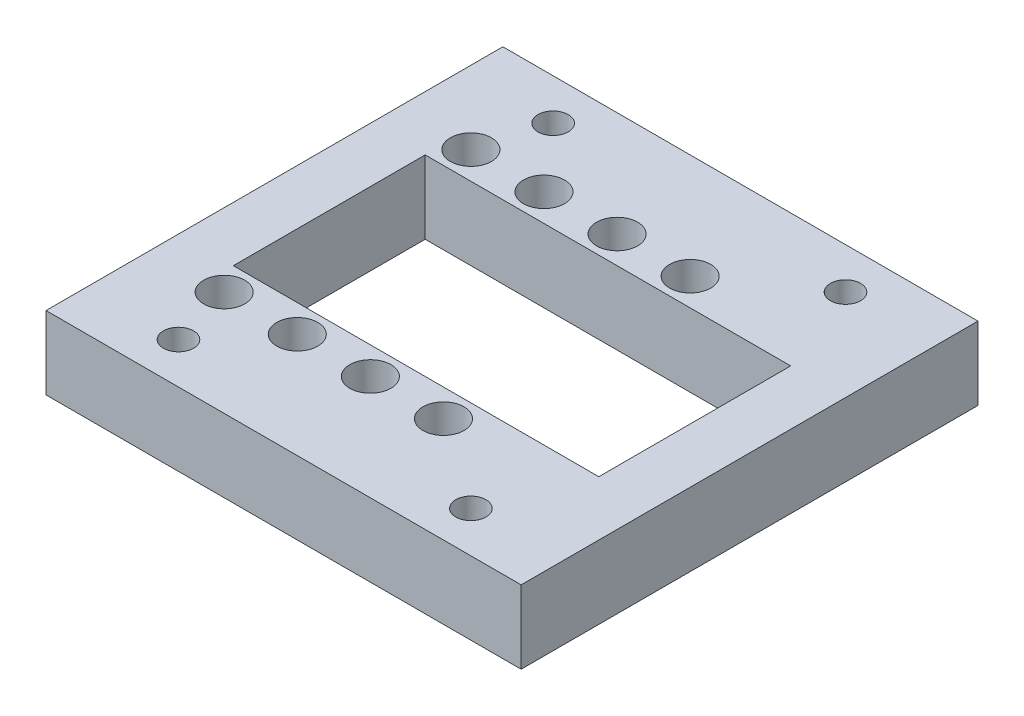
ISO-10303-21;
HEADER;
FILE_DESCRIPTION(('STEP AP214'),'2;1');
FILE_NAME('part.step','',(''),(''),'','','');
FILE_SCHEMA(('AUTOMOTIVE_DESIGN { 1 0 10303 214 1 1 1 1 }'));
ENDSEC;
DATA;
#1=APPLICATION_CONTEXT('core data for automotive mechanical design processes');
#2=APPLICATION_PROTOCOL_DEFINITION('international standard','automotive_design',2000,#1);
#3=PRODUCT_CONTEXT('',#1,'mechanical');
#4=PRODUCT('Part','Part','',(#3));
#5=PRODUCT_RELATED_PRODUCT_CATEGORY('part','',(#4));
#6=PRODUCT_DEFINITION_FORMATION('','',#4);
#7=PRODUCT_DEFINITION_CONTEXT('part definition',#1,'design');
#8=PRODUCT_DEFINITION('design','',#6,#7);
#9=PRODUCT_DEFINITION_SHAPE('','',#8);
#10=(LENGTH_UNIT() NAMED_UNIT(*) SI_UNIT(.MILLI.,.METRE.));
#11=(NAMED_UNIT(*) PLANE_ANGLE_UNIT() SI_UNIT($,.RADIAN.));
#12=(NAMED_UNIT(*) SI_UNIT($,.STERADIAN.) SOLID_ANGLE_UNIT());
#13=UNCERTAINTY_MEASURE_WITH_UNIT(LENGTH_MEASURE(1.E-05),#10,'distance_accuracy_value','');
#14=(GEOMETRIC_REPRESENTATION_CONTEXT(3) GLOBAL_UNCERTAINTY_ASSIGNED_CONTEXT((#13)) GLOBAL_UNIT_ASSIGNED_CONTEXT((#10,
#11,#12)) REPRESENTATION_CONTEXT('',''));
#15=CARTESIAN_POINT('',(0.,0.,0.));
#16=DIRECTION('',(0.,0.,1.));
#17=DIRECTION('',(1.,0.,0.));
#18=AXIS2_PLACEMENT_3D('',#15,#16,#17);
#19=CARTESIAN_POINT('',(0.,8.,13.5));
#20=DIRECTION('',(0.,-1.,0.));
#21=DIRECTION('',(0.,0.,-1.));
#22=AXIS2_PLACEMENT_3D('',#19,#20,#21);
#23=CYLINDRICAL_SURFACE('',#22,1.12499999999999);
#24=CARTESIAN_POINT('',(0.,0.,13.5));
#25=DIRECTION('',(0.,1.,0.));
#26=DIRECTION('',(0.,0.,1.));
#27=AXIS2_PLACEMENT_3D('',#24,#25,#26);
#28=CIRCLE('',#27,1.12499999999999);
#29=CARTESIAN_POINT('',(0.,0.,14.625));
#30=VERTEX_POINT('',#29);
#31=EDGE_CURVE('E187',#30,#30,#28,.F.);
#32=ORIENTED_EDGE('',*,*,#31,.T.);
#33=EDGE_LOOP('',(#32));
#34=FACE_BOUND('',#33,.T.);
#35=CARTESIAN_POINT('',(0.,4.5,13.5));
#36=DIRECTION('',(0.,1.,0.));
#37=DIRECTION('',(0.,0.,1.));
#38=AXIS2_PLACEMENT_3D('',#35,#36,#37);
#39=CIRCLE('',#38,1.12499999999999);
#40=CARTESIAN_POINT('',(0.,4.5,14.625));
#41=VERTEX_POINT('',#40);
#42=EDGE_CURVE('E706',#41,#41,#39,.F.);
#43=ORIENTED_EDGE('',*,*,#42,.F.);
#44=EDGE_LOOP('',(#43));
#45=FACE_BOUND('',#44,.T.);
#46=ADVANCED_FACE('F35',(#34,#45),#23,.F.);
#47=CARTESIAN_POINT('',(16.,8.,13.5));
#48=DIRECTION('',(0.,-1.,0.));
#49=DIRECTION('',(0.,0.,-1.));
#50=AXIS2_PLACEMENT_3D('',#47,#48,#49);
#51=CYLINDRICAL_SURFACE('',#50,1.125);
#52=CARTESIAN_POINT('',(16.,0.,13.5));
#53=DIRECTION('',(0.,1.,0.));
#54=DIRECTION('',(0.,0.,1.));
#55=AXIS2_PLACEMENT_3D('',#52,#53,#54);
#56=CIRCLE('',#55,1.125);
#57=CARTESIAN_POINT('',(16.,0.,14.625));
#58=VERTEX_POINT('',#57);
#59=EDGE_CURVE('E184',#58,#58,#56,.F.);
#60=ORIENTED_EDGE('',*,*,#59,.T.);
#61=EDGE_LOOP('',(#60));
#62=FACE_BOUND('',#61,.T.);
#63=CARTESIAN_POINT('',(16.,4.5,13.5));
#64=DIRECTION('',(0.,1.,0.));
#65=DIRECTION('',(0.,0.,1.));
#66=AXIS2_PLACEMENT_3D('',#63,#64,#65);
#67=CIRCLE('',#66,1.125);
#68=CARTESIAN_POINT('',(16.,4.5,14.625));
#69=VERTEX_POINT('',#68);
#70=EDGE_CURVE('E309',#69,#69,#67,.F.);
#71=ORIENTED_EDGE('',*,*,#70,.F.);
#72=EDGE_LOOP('',(#71));
#73=FACE_BOUND('',#72,.T.);
#74=ADVANCED_FACE('F229',(#62,#73),#51,.F.);
#75=CARTESIAN_POINT('',(0.,8.,-13.5));
#76=DIRECTION('',(0.,-1.,0.));
#77=DIRECTION('',(0.,0.,-1.));
#78=AXIS2_PLACEMENT_3D('',#75,#76,#77);
#79=CYLINDRICAL_SURFACE('',#78,1.125);
#80=CARTESIAN_POINT('',(0.,0.,-13.5));
#81=DIRECTION('',(0.,1.,0.));
#82=DIRECTION('',(0.,0.,1.));
#83=AXIS2_PLACEMENT_3D('',#80,#81,#82);
#84=CIRCLE('',#83,1.125);
#85=CARTESIAN_POINT('',(0.,0.,-12.375));
#86=VERTEX_POINT('',#85);
#87=EDGE_CURVE('E173',#86,#86,#84,.T.);
#88=ORIENTED_EDGE('',*,*,#87,.F.);
#89=EDGE_LOOP('',(#88));
#90=FACE_BOUND('',#89,.T.);
#91=CARTESIAN_POINT('',(0.,4.5,-13.5));
#92=DIRECTION('',(0.,1.,0.));
#93=DIRECTION('',(0.,0.,1.));
#94=AXIS2_PLACEMENT_3D('',#91,#92,#93);
#95=CIRCLE('',#94,1.125);
#96=CARTESIAN_POINT('',(0.,4.5,-12.375));
#97=VERTEX_POINT('',#96);
#98=EDGE_CURVE('E319',#97,#97,#95,.F.);
#99=ORIENTED_EDGE('',*,*,#98,.F.);
#100=EDGE_LOOP('',(#99));
#101=FACE_BOUND('',#100,.T.);
#102=ADVANCED_FACE('F235',(#90,#101),#79,.F.);
#103=CARTESIAN_POINT('',(7.99999999999999,8.,-13.5));
#104=DIRECTION('',(0.,-1.,0.));
#105=DIRECTION('',(0.,0.,-1.));
#106=AXIS2_PLACEMENT_3D('',#103,#104,#105);
#107=CYLINDRICAL_SURFACE('',#106,1.125);
#108=CARTESIAN_POINT('',(7.99999999999999,0.,-13.5));
#109=DIRECTION('',(0.,1.,0.));
#110=DIRECTION('',(0.,0.,1.));
#111=AXIS2_PLACEMENT_3D('',#108,#109,#110);
#112=CIRCLE('',#111,1.125);
#113=CARTESIAN_POINT('',(7.99999999999999,0.,-12.375));
#114=VERTEX_POINT('',#113);
#115=EDGE_CURVE('E170',#114,#114,#112,.T.);
#116=ORIENTED_EDGE('',*,*,#115,.F.);
#117=EDGE_LOOP('',(#116));
#118=FACE_BOUND('',#117,.T.);
#119=CARTESIAN_POINT('',(7.99999999999999,4.5,-13.5));
#120=DIRECTION('',(0.,1.,0.));
#121=DIRECTION('',(0.,0.,1.));
#122=AXIS2_PLACEMENT_3D('',#119,#120,#121);
#123=CIRCLE('',#122,1.125);
#124=CARTESIAN_POINT('',(7.99999999999999,4.5,-12.375));
#125=VERTEX_POINT('',#124);
#126=EDGE_CURVE('E697',#125,#125,#123,.F.);
#127=ORIENTED_EDGE('',*,*,#126,.F.);
#128=EDGE_LOOP('',(#127));
#129=FACE_BOUND('',#128,.T.);
#130=ADVANCED_FACE('F252',(#118,#129),#107,.F.);
#131=CARTESIAN_POINT('',(16.,8.,-13.5));
#132=DIRECTION('',(0.,-1.,0.));
#133=DIRECTION('',(0.,0.,-1.));
#134=AXIS2_PLACEMENT_3D('',#131,#132,#133);
#135=CYLINDRICAL_SURFACE('',#134,1.125);
#136=CARTESIAN_POINT('',(16.,0.,-13.5));
#137=DIRECTION('',(0.,1.,0.));
#138=DIRECTION('',(0.,0.,1.));
#139=AXIS2_PLACEMENT_3D('',#136,#137,#138);
#140=CIRCLE('',#139,1.125);
#141=CARTESIAN_POINT('',(16.,0.,-12.375));
#142=VERTEX_POINT('',#141);
#143=EDGE_CURVE('E167',#142,#142,#140,.T.);
#144=ORIENTED_EDGE('',*,*,#143,.F.);
#145=EDGE_LOOP('',(#144));
#146=FACE_BOUND('',#145,.T.);
#147=CARTESIAN_POINT('',(16.,4.5,-13.5));
#148=DIRECTION('',(0.,1.,0.));
#149=DIRECTION('',(0.,0.,1.));
#150=AXIS2_PLACEMENT_3D('',#147,#148,#149);
#151=CIRCLE('',#150,1.125);
#152=CARTESIAN_POINT('',(16.,4.5,-12.375));
#153=VERTEX_POINT('',#152);
#154=EDGE_CURVE('E688',#153,#153,#151,.F.);
#155=ORIENTED_EDGE('',*,*,#154,.F.);
#156=EDGE_LOOP('',(#155));
#157=FACE_BOUND('',#156,.T.);
#158=ADVANCED_FACE('F256',(#146,#157),#135,.F.);
#159=CARTESIAN_POINT('',(24.,8.,-13.5));
#160=DIRECTION('',(0.,-1.,0.));
#161=DIRECTION('',(0.,0.,-1.));
#162=AXIS2_PLACEMENT_3D('',#159,#160,#161);
#163=CYLINDRICAL_SURFACE('',#162,1.125);
#164=CARTESIAN_POINT('',(24.,0.,-13.5));
#165=DIRECTION('',(0.,1.,0.));
#166=DIRECTION('',(0.,0.,1.));
#167=AXIS2_PLACEMENT_3D('',#164,#165,#166);
#168=CIRCLE('',#167,1.125);
#169=CARTESIAN_POINT('',(24.,0.,-12.375));
#170=VERTEX_POINT('',#169);
#171=EDGE_CURVE('E164',#170,#170,#168,.T.);
#172=ORIENTED_EDGE('',*,*,#171,.F.);
#173=EDGE_LOOP('',(#172));
#174=FACE_BOUND('',#173,.T.);
#175=CARTESIAN_POINT('',(24.,4.5,-13.5));
#176=DIRECTION('',(0.,1.,0.));
#177=DIRECTION('',(0.,0.,1.));
#178=AXIS2_PLACEMENT_3D('',#175,#176,#177);
#179=CIRCLE('',#178,1.125);
#180=CARTESIAN_POINT('',(24.,4.5,-12.375));
#181=VERTEX_POINT('',#180);
#182=EDGE_CURVE('E675',#181,#181,#179,.F.);
#183=ORIENTED_EDGE('',*,*,#182,.F.);
#184=EDGE_LOOP('',(#183));
#185=FACE_BOUND('',#184,.T.);
#186=ADVANCED_FACE('F260',(#174,#185),#163,.F.);
#187=CARTESIAN_POINT('',(24.,8.,13.5));
#188=DIRECTION('',(0.,-1.,0.));
#189=DIRECTION('',(0.,0.,-1.));
#190=AXIS2_PLACEMENT_3D('',#187,#188,#189);
#191=CYLINDRICAL_SURFACE('',#190,1.125);
#192=CARTESIAN_POINT('',(24.,0.,13.5));
#193=DIRECTION('',(0.,1.,0.));
#194=DIRECTION('',(0.,0.,1.));
#195=AXIS2_PLACEMENT_3D('',#192,#193,#194);
#196=CIRCLE('',#195,1.125);
#197=CARTESIAN_POINT('',(24.,0.,14.625));
#198=VERTEX_POINT('',#197);
#199=EDGE_CURVE('E161',#198,#198,#196,.F.);
#200=ORIENTED_EDGE('',*,*,#199,.T.);
#201=EDGE_LOOP('',(#200));
#202=FACE_BOUND('',#201,.T.);
#203=CARTESIAN_POINT('',(24.,4.5,13.5));
#204=DIRECTION('',(0.,1.,0.));
#205=DIRECTION('',(0.,0.,1.));
#206=AXIS2_PLACEMENT_3D('',#203,#204,#205);
#207=CIRCLE('',#206,1.125);
#208=CARTESIAN_POINT('',(24.,4.5,14.625));
#209=VERTEX_POINT('',#208);
#210=EDGE_CURVE('E312',#209,#209,#207,.F.);
#211=ORIENTED_EDGE('',*,*,#210,.F.);
#212=EDGE_LOOP('',(#211));
#213=FACE_BOUND('',#212,.T.);
#214=ADVANCED_FACE('F264',(#202,#213),#191,.F.);
#215=CARTESIAN_POINT('',(7.99999999999999,8.,13.5));
#216=DIRECTION('',(0.,-1.,0.));
#217=DIRECTION('',(0.,0.,-1.));
#218=AXIS2_PLACEMENT_3D('',#215,#216,#217);
#219=CYLINDRICAL_SURFACE('',#218,1.125);
#220=CARTESIAN_POINT('',(7.99999999999999,0.,13.5));
#221=DIRECTION('',(0.,1.,0.));
#222=DIRECTION('',(0.,0.,1.));
#223=AXIS2_PLACEMENT_3D('',#220,#221,#222);
#224=CIRCLE('',#223,1.125);
#225=CARTESIAN_POINT('',(7.99999999999999,0.,14.625));
#226=VERTEX_POINT('',#225);
#227=EDGE_CURVE('E158',#226,#226,#224,.F.);
#228=ORIENTED_EDGE('',*,*,#227,.T.);
#229=EDGE_LOOP('',(#228));
#230=FACE_BOUND('',#229,.T.);
#231=CARTESIAN_POINT('',(7.99999999999999,4.5,13.5));
#232=DIRECTION('',(0.,1.,0.));
#233=DIRECTION('',(0.,0.,1.));
#234=AXIS2_PLACEMENT_3D('',#231,#232,#233);
#235=CIRCLE('',#234,1.125);
#236=CARTESIAN_POINT('',(7.99999999999999,4.5,14.625));
#237=VERTEX_POINT('',#236);
#238=EDGE_CURVE('E713',#237,#237,#235,.F.);
#239=ORIENTED_EDGE('',*,*,#238,.F.);
#240=EDGE_LOOP('',(#239));
#241=FACE_BOUND('',#240,.T.);
#242=ADVANCED_FACE('F268',(#230,#241),#219,.F.);
#243=CARTESIAN_POINT('',(0.,8.,0.));
#244=DIRECTION('',(0.,1.,0.));
#245=DIRECTION('',(0.,0.,1.));
#246=AXIS2_PLACEMENT_3D('',#243,#244,#245);
#247=PLANE('',#246);
#248=CARTESIAN_POINT('',(7.99999999999999,8.,-13.5));
#249=DIRECTION('',(0.,1.,0.));
#250=DIRECTION('',(0.,0.,1.));
#251=AXIS2_PLACEMENT_3D('',#248,#249,#250);
#252=CIRCLE('',#251,2.25);
#253=CARTESIAN_POINT('',(7.99999999999999,8.,-11.25));
#254=VERTEX_POINT('',#253);
#255=EDGE_CURVE('E692',#254,#254,#252,.T.);
#256=ORIENTED_EDGE('',*,*,#255,.F.);
#257=EDGE_LOOP('',(#256));
#258=FACE_BOUND('',#257,.T.);
#259=CARTESIAN_POINT('',(16.,8.,-13.5));
#260=DIRECTION('',(0.,1.,0.));
#261=DIRECTION('',(0.,0.,1.));
#262=AXIS2_PLACEMENT_3D('',#259,#260,#261);
#263=CIRCLE('',#262,2.25);
#264=CARTESIAN_POINT('',(16.,8.,-11.25));
#265=VERTEX_POINT('',#264);
#266=EDGE_CURVE('E684',#265,#265,#263,.T.);
#267=ORIENTED_EDGE('',*,*,#266,.F.);
#268=EDGE_LOOP('',(#267));
#269=FACE_BOUND('',#268,.T.);
#270=CARTESIAN_POINT('',(24.,8.,-13.5));
#271=DIRECTION('',(0.,1.,0.));
#272=DIRECTION('',(0.,0.,1.));
#273=AXIS2_PLACEMENT_3D('',#270,#271,#272);
#274=CIRCLE('',#273,2.25);
#275=CARTESIAN_POINT('',(24.,8.,-11.25));
#276=VERTEX_POINT('',#275);
#277=EDGE_CURVE('E673',#276,#276,#274,.T.);
#278=ORIENTED_EDGE('',*,*,#277,.F.);
#279=EDGE_LOOP('',(#278));
#280=FACE_BOUND('',#279,.T.);
#281=CARTESIAN_POINT('',(16.,8.,13.5));
#282=DIRECTION('',(0.,1.,0.));
#283=DIRECTION('',(0.,0.,1.));
#284=AXIS2_PLACEMENT_3D('',#281,#282,#283);
#285=CIRCLE('',#284,2.25);
#286=CARTESIAN_POINT('',(16.,8.,15.75));
#287=VERTEX_POINT('',#286);
#288=EDGE_CURVE('E716',#287,#287,#285,.F.);
#289=ORIENTED_EDGE('',*,*,#288,.T.);
#290=EDGE_LOOP('',(#289));
#291=FACE_BOUND('',#290,.T.);
#292=CARTESIAN_POINT('',(0.,8.,13.5));
#293=DIRECTION('',(0.,1.,0.));
#294=DIRECTION('',(0.,0.,1.));
#295=AXIS2_PLACEMENT_3D('',#292,#293,#294);
#296=CIRCLE('',#295,2.25);
#297=CARTESIAN_POINT('',(0.,8.,15.75));
#298=VERTEX_POINT('',#297);
#299=EDGE_CURVE('E702',#298,#298,#296,.F.);
#300=ORIENTED_EDGE('',*,*,#299,.T.);
#301=EDGE_LOOP('',(#300));
#302=FACE_BOUND('',#301,.T.);
#303=CARTESIAN_POINT('',(0.,8.,-13.5));
#304=DIRECTION('',(0.,1.,0.));
#305=DIRECTION('',(0.,0.,1.));
#306=AXIS2_PLACEMENT_3D('',#303,#304,#305);
#307=CIRCLE('',#306,2.25);
#308=CARTESIAN_POINT('',(0.,8.,-11.25));
#309=VERTEX_POINT('',#308);
#310=EDGE_CURVE('E322',#309,#309,#307,.T.);
#311=ORIENTED_EDGE('',*,*,#310,.F.);
#312=EDGE_LOOP('',(#311));
#313=FACE_BOUND('',#312,.T.);
#314=DIRECTION('',(0.,0.,-1.));
#315=VECTOR('',#314,1.);
#316=CARTESIAN_POINT('',(44.,8.,0.));
#317=LINE('',#316,#315);
#318=CARTESIAN_POINT('',(44.,8.,25.));
#319=VERTEX_POINT('',#318);
#320=CARTESIAN_POINT('',(44.,8.,-25.));
#321=VERTEX_POINT('',#320);
#322=EDGE_CURVE('E193',#319,#321,#317,.T.);
#323=ORIENTED_EDGE('',*,*,#322,.T.);
#324=DIRECTION('',(-1.,0.,0.));
#325=VECTOR('',#324,1.);
#326=CARTESIAN_POINT('',(0.,8.,-25.));
#327=LINE('',#326,#325);
#328=CARTESIAN_POINT('',(-8.,8.,-25.));
#329=VERTEX_POINT('',#328);
#330=EDGE_CURVE('E93',#321,#329,#327,.T.);
#331=ORIENTED_EDGE('',*,*,#330,.T.);
#332=DIRECTION('',(0.,0.,-1.));
#333=VECTOR('',#332,1.);
#334=CARTESIAN_POINT('',(-8.,8.,0.));
#335=LINE('',#334,#333);
#336=CARTESIAN_POINT('',(-7.99999999999999,8.,25.));
#337=VERTEX_POINT('',#336);
#338=EDGE_CURVE('E330',#337,#329,#335,.T.);
#339=ORIENTED_EDGE('',*,*,#338,.F.);
#340=DIRECTION('',(-1.,0.,0.));
#341=VECTOR('',#340,1.);
#342=CARTESIAN_POINT('',(0.,8.,25.));
#343=LINE('',#342,#341);
#344=EDGE_CURVE('E215',#319,#337,#343,.T.);
#345=ORIENTED_EDGE('',*,*,#344,.F.);
#346=EDGE_LOOP('',(#323,#331,#339,#345));
#347=FACE_BOUND('',#346,.T.);
#348=CARTESIAN_POINT('',(2.00000000000001,8.,20.5));
#349=DIRECTION('',(0.,1.,0.));
#350=DIRECTION('',(0.,0.,1.));
#351=AXIS2_PLACEMENT_3D('',#348,#349,#350);
#352=CIRCLE('',#351,1.65);
#353=CARTESIAN_POINT('',(2.00000000000001,8.,22.15));
#354=VERTEX_POINT('',#353);
#355=EDGE_CURVE('E333',#354,#354,#352,.T.);
#356=ORIENTED_EDGE('',*,*,#355,.F.);
#357=EDGE_LOOP('',(#356));
#358=FACE_BOUND('',#357,.T.);
#359=CARTESIAN_POINT('',(2.00000000000001,8.,-20.5));
#360=DIRECTION('',(0.,1.,0.));
#361=DIRECTION('',(0.,0.,1.));
#362=AXIS2_PLACEMENT_3D('',#359,#360,#361);
#363=CIRCLE('',#362,1.65);
#364=CARTESIAN_POINT('',(2.00000000000001,8.,-18.85));
#365=VERTEX_POINT('',#364);
#366=EDGE_CURVE('E336',#365,#365,#363,.F.);
#367=ORIENTED_EDGE('',*,*,#366,.T.);
#368=EDGE_LOOP('',(#367));
#369=FACE_BOUND('',#368,.T.);
#370=CARTESIAN_POINT('',(34.,8.,-20.5));
#371=DIRECTION('',(0.,1.,0.));
#372=DIRECTION('',(0.,0.,1.));
#373=AXIS2_PLACEMENT_3D('',#370,#371,#372);
#374=CIRCLE('',#373,1.65);
#375=CARTESIAN_POINT('',(34.,8.,-18.85));
#376=VERTEX_POINT('',#375);
#377=EDGE_CURVE('E339',#376,#376,#374,.T.);
#378=ORIENTED_EDGE('',*,*,#377,.F.);
#379=EDGE_LOOP('',(#378));
#380=FACE_BOUND('',#379,.T.);
#381=DIRECTION('',(1.,0.,0.));
#382=VECTOR('',#381,1.);
#383=CARTESIAN_POINT('',(0.,8.,-10.5));
#384=LINE('',#383,#382);
#385=CARTESIAN_POINT('',(-2.,8.,-10.5));
#386=VERTEX_POINT('',#385);
#387=CARTESIAN_POINT('',(38.,8.,-10.5));
#388=VERTEX_POINT('',#387);
#389=EDGE_CURVE('E116',#386,#388,#384,.T.);
#390=ORIENTED_EDGE('',*,*,#389,.T.);
#391=DIRECTION('',(0.,0.,1.));
#392=VECTOR('',#391,1.);
#393=CARTESIAN_POINT('',(38.,8.,0.));
#394=LINE('',#393,#392);
#395=CARTESIAN_POINT('',(38.,8.,10.5));
#396=VERTEX_POINT('',#395);
#397=EDGE_CURVE('E109',#388,#396,#394,.T.);
#398=ORIENTED_EDGE('',*,*,#397,.T.);
#399=DIRECTION('',(1.,0.,0.));
#400=VECTOR('',#399,1.);
#401=CARTESIAN_POINT('',(0.,8.,10.5));
#402=LINE('',#401,#400);
#403=CARTESIAN_POINT('',(-2.,8.,10.5));
#404=VERTEX_POINT('',#403);
#405=EDGE_CURVE('E115',#404,#396,#402,.T.);
#406=ORIENTED_EDGE('',*,*,#405,.F.);
#407=DIRECTION('',(0.,0.,1.));
#408=VECTOR('',#407,1.);
#409=CARTESIAN_POINT('',(-2.,8.,0.));
#410=LINE('',#409,#408);
#411=EDGE_CURVE('E127',#386,#404,#410,.T.);
#412=ORIENTED_EDGE('',*,*,#411,.F.);
#413=EDGE_LOOP('',(#390,#398,#406,#412));
#414=FACE_BOUND('',#413,.T.);
#415=CARTESIAN_POINT('',(34.,8.,20.5));
#416=DIRECTION('',(0.,1.,0.));
#417=DIRECTION('',(0.,0.,1.));
#418=AXIS2_PLACEMENT_3D('',#415,#416,#417);
#419=CIRCLE('',#418,1.65);
#420=CARTESIAN_POINT('',(34.,8.,22.15));
#421=VERTEX_POINT('',#420);
#422=EDGE_CURVE('E129',#421,#421,#419,.F.);
#423=ORIENTED_EDGE('',*,*,#422,.T.);
#424=EDGE_LOOP('',(#423));
#425=FACE_BOUND('',#424,.T.);
#426=CARTESIAN_POINT('',(8.,8.,13.5));
#427=DIRECTION('',(0.,1.,0.));
#428=DIRECTION('',(0.,0.,1.));
#429=AXIS2_PLACEMENT_3D('',#426,#427,#428);
#430=CIRCLE('',#429,2.25);
#431=CARTESIAN_POINT('',(8.,8.,15.75));
#432=VERTEX_POINT('',#431);
#433=EDGE_CURVE('E303',#432,#432,#430,.F.);
#434=ORIENTED_EDGE('',*,*,#433,.T.);
#435=EDGE_LOOP('',(#434));
#436=FACE_BOUND('',#435,.T.);
#437=CARTESIAN_POINT('',(24.,8.,13.5));
#438=DIRECTION('',(0.,1.,0.));
#439=DIRECTION('',(0.,0.,1.));
#440=AXIS2_PLACEMENT_3D('',#437,#438,#439);
#441=CIRCLE('',#440,2.25);
#442=CARTESIAN_POINT('',(24.,8.,15.75));
#443=VERTEX_POINT('',#442);
#444=EDGE_CURVE('E306',#443,#443,#441,.F.);
#445=ORIENTED_EDGE('',*,*,#444,.T.);
#446=EDGE_LOOP('',(#445));
#447=FACE_BOUND('',#446,.T.);
#448=ADVANCED_FACE('F111',(#258,#269,#280,#291,#302,#313,#347,#358,#369,#380,#414,#425,#436,
#447),#247,.T.);
#449=CARTESIAN_POINT('',(0.,8.,-10.5));
#450=DIRECTION('',(0.,0.,-1.));
#451=DIRECTION('',(-1.,0.,0.));
#452=AXIS2_PLACEMENT_3D('',#449,#450,#451);
#453=PLANE('',#452);
#454=DIRECTION('',(1.,0.,0.));
#455=VECTOR('',#454,1.);
#456=CARTESIAN_POINT('',(0.,0.,-10.5));
#457=LINE('',#456,#455);
#458=CARTESIAN_POINT('',(-2.,0.,-10.5));
#459=VERTEX_POINT('',#458);
#460=CARTESIAN_POINT('',(38.,0.,-10.5));
#461=VERTEX_POINT('',#460);
#462=EDGE_CURVE('E176',#459,#461,#457,.T.);
#463=ORIENTED_EDGE('',*,*,#462,.T.);
#464=DIRECTION('',(0.,-1.,0.));
#465=VECTOR('',#464,1.);
#466=CARTESIAN_POINT('',(38.,8.,-10.5));
#467=LINE('',#466,#465);
#468=EDGE_CURVE('E11',#388,#461,#467,.T.);
#469=ORIENTED_EDGE('',*,*,#468,.F.);
#470=ORIENTED_EDGE('',*,*,#389,.F.);
#471=DIRECTION('',(0.,-1.,0.));
#472=VECTOR('',#471,1.);
#473=CARTESIAN_POINT('',(-2.,8.,-10.5));
#474=LINE('',#473,#472);
#475=EDGE_CURVE('E54',#386,#459,#474,.T.);
#476=ORIENTED_EDGE('',*,*,#475,.T.);
#477=EDGE_LOOP('',(#463,#469,#470,#476));
#478=FACE_BOUND('',#477,.T.);
#479=ADVANCED_FACE('F247',(#478),#453,.F.);
#480=CARTESIAN_POINT('',(38.,8.,0.));
#481=DIRECTION('',(1.,0.,0.));
#482=DIRECTION('',(0.,0.,-1.));
#483=AXIS2_PLACEMENT_3D('',#480,#481,#482);
#484=PLANE('',#483);
#485=DIRECTION('',(0.,0.,1.));
#486=VECTOR('',#485,1.);
#487=CARTESIAN_POINT('',(38.,0.,0.));
#488=LINE('',#487,#486);
#489=CARTESIAN_POINT('',(38.,0.,10.5));
#490=VERTEX_POINT('',#489);
#491=EDGE_CURVE('E122',#461,#490,#488,.T.);
#492=ORIENTED_EDGE('',*,*,#491,.T.);
#493=DIRECTION('',(0.,-1.,0.));
#494=VECTOR('',#493,1.);
#495=CARTESIAN_POINT('',(38.,8.,10.5));
#496=LINE('',#495,#494);
#497=EDGE_CURVE('E45',#396,#490,#496,.T.);
#498=ORIENTED_EDGE('',*,*,#497,.F.);
#499=ORIENTED_EDGE('',*,*,#397,.F.);
#500=ORIENTED_EDGE('',*,*,#468,.T.);
#501=EDGE_LOOP('',(#492,#498,#499,#500));
#502=FACE_BOUND('',#501,.T.);
#503=ADVANCED_FACE('F121',(#502),#484,.F.);
#504=CARTESIAN_POINT('',(0.,8.,10.5));
#505=DIRECTION('',(0.,0.,-1.));
#506=DIRECTION('',(-1.,0.,0.));
#507=AXIS2_PLACEMENT_3D('',#504,#505,#506);
#508=PLANE('',#507);
#509=DIRECTION('',(1.,0.,0.));
#510=VECTOR('',#509,1.);
#511=CARTESIAN_POINT('',(0.,0.,10.5));
#512=LINE('',#511,#510);
#513=CARTESIAN_POINT('',(-2.,0.,10.5));
#514=VERTEX_POINT('',#513);
#515=EDGE_CURVE('E179',#514,#490,#512,.T.);
#516=ORIENTED_EDGE('',*,*,#515,.F.);
#517=DIRECTION('',(0.,-1.,0.));
#518=VECTOR('',#517,1.);
#519=CARTESIAN_POINT('',(-2.,8.,10.5));
#520=LINE('',#519,#518);
#521=EDGE_CURVE('E80',#404,#514,#520,.T.);
#522=ORIENTED_EDGE('',*,*,#521,.F.);
#523=ORIENTED_EDGE('',*,*,#405,.T.);
#524=ORIENTED_EDGE('',*,*,#497,.T.);
#525=EDGE_LOOP('',(#516,#522,#523,#524));
#526=FACE_BOUND('',#525,.T.);
#527=ADVANCED_FACE('F126',(#526),#508,.T.);
#528=CARTESIAN_POINT('',(44.,8.,0.));
#529=DIRECTION('',(-1.,0.,0.));
#530=DIRECTION('',(0.,0.,1.));
#531=AXIS2_PLACEMENT_3D('',#528,#529,#530);
#532=PLANE('',#531);
#533=DIRECTION('',(0.,0.,-1.));
#534=VECTOR('',#533,1.);
#535=CARTESIAN_POINT('',(44.,0.,0.));
#536=LINE('',#535,#534);
#537=CARTESIAN_POINT('',(44.,0.,25.));
#538=VERTEX_POINT('',#537);
#539=CARTESIAN_POINT('',(44.,0.,-25.));
#540=VERTEX_POINT('',#539);
#541=EDGE_CURVE('E136',#538,#540,#536,.T.);
#542=ORIENTED_EDGE('',*,*,#541,.T.);
#543=DIRECTION('',(0.,-1.,0.));
#544=VECTOR('',#543,1.);
#545=CARTESIAN_POINT('',(44.,8.,-25.));
#546=LINE('',#545,#544);
#547=EDGE_CURVE('E39',#321,#540,#546,.T.);
#548=ORIENTED_EDGE('',*,*,#547,.F.);
#549=ORIENTED_EDGE('',*,*,#322,.F.);
#550=DIRECTION('',(0.,-1.,0.));
#551=VECTOR('',#550,1.);
#552=CARTESIAN_POINT('',(44.,8.,25.));
#553=LINE('',#552,#551);
#554=EDGE_CURVE('E135',#319,#538,#553,.T.);
#555=ORIENTED_EDGE('',*,*,#554,.T.);
#556=EDGE_LOOP('',(#542,#548,#549,#555));
#557=FACE_BOUND('',#556,.T.);
#558=ADVANCED_FACE('F37',(#557),#532,.F.);
#559=CARTESIAN_POINT('',(0.,8.,-25.));
#560=DIRECTION('',(0.,0.,1.));
#561=DIRECTION('',(1.,0.,0.));
#562=AXIS2_PLACEMENT_3D('',#559,#560,#561);
#563=PLANE('',#562);
#564=DIRECTION('',(-1.,0.,0.));
#565=VECTOR('',#564,1.);
#566=CARTESIAN_POINT('',(0.,0.,-25.));
#567=LINE('',#566,#565);
#568=CARTESIAN_POINT('',(-8.,0.,-25.));
#569=VERTEX_POINT('',#568);
#570=EDGE_CURVE('E139',#540,#569,#567,.T.);
#571=ORIENTED_EDGE('',*,*,#570,.T.);
#572=DIRECTION('',(0.,-1.,0.));
#573=VECTOR('',#572,1.);
#574=CARTESIAN_POINT('',(-8.,8.,-25.));
#575=LINE('',#574,#573);
#576=EDGE_CURVE('E198',#329,#569,#575,.T.);
#577=ORIENTED_EDGE('',*,*,#576,.F.);
#578=ORIENTED_EDGE('',*,*,#330,.F.);
#579=ORIENTED_EDGE('',*,*,#547,.T.);
#580=EDGE_LOOP('',(#571,#577,#578,#579));
#581=FACE_BOUND('',#580,.T.);
#582=ADVANCED_FACE('F203',(#581),#563,.F.);
#583=CARTESIAN_POINT('',(-8.,8.,0.));
#584=DIRECTION('',(-1.,0.,0.));
#585=DIRECTION('',(0.,0.,1.));
#586=AXIS2_PLACEMENT_3D('',#583,#584,#585);
#587=PLANE('',#586);
#588=DIRECTION('',(0.,0.,-1.));
#589=VECTOR('',#588,1.);
#590=CARTESIAN_POINT('',(-8.,0.,0.));
#591=LINE('',#590,#589);
#592=CARTESIAN_POINT('',(-7.99999999999999,0.,25.));
#593=VERTEX_POINT('',#592);
#594=EDGE_CURVE('E143',#593,#569,#591,.T.);
#595=ORIENTED_EDGE('',*,*,#594,.F.);
#596=DIRECTION('',(0.,-1.,0.));
#597=VECTOR('',#596,1.);
#598=CARTESIAN_POINT('',(-7.99999999999999,8.,25.));
#599=LINE('',#598,#597);
#600=EDGE_CURVE('E197',#337,#593,#599,.T.);
#601=ORIENTED_EDGE('',*,*,#600,.F.);
#602=ORIENTED_EDGE('',*,*,#338,.T.);
#603=ORIENTED_EDGE('',*,*,#576,.T.);
#604=EDGE_LOOP('',(#595,#601,#602,#603));
#605=FACE_BOUND('',#604,.T.);
#606=ADVANCED_FACE('F217',(#605),#587,.T.);
#607=CARTESIAN_POINT('',(-2.,8.,0.));
#608=DIRECTION('',(1.,0.,0.));
#609=DIRECTION('',(0.,0.,-1.));
#610=AXIS2_PLACEMENT_3D('',#607,#608,#609);
#611=PLANE('',#610);
#612=DIRECTION('',(0.,0.,1.));
#613=VECTOR('',#612,1.);
#614=CARTESIAN_POINT('',(-2.,0.,0.));
#615=LINE('',#614,#613);
#616=EDGE_CURVE('E181',#459,#514,#615,.T.);
#617=ORIENTED_EDGE('',*,*,#616,.F.);
#618=ORIENTED_EDGE('',*,*,#475,.F.);
#619=ORIENTED_EDGE('',*,*,#411,.T.);
#620=ORIENTED_EDGE('',*,*,#521,.T.);
#621=EDGE_LOOP('',(#617,#618,#619,#620));
#622=FACE_BOUND('',#621,.T.);
#623=ADVANCED_FACE('F219',(#622),#611,.T.);
#624=CARTESIAN_POINT('',(34.,8.,-20.5));
#625=DIRECTION('',(0.,-1.,0.));
#626=DIRECTION('',(0.,0.,-1.));
#627=AXIS2_PLACEMENT_3D('',#624,#625,#626);
#628=CYLINDRICAL_SURFACE('',#627,1.65);
#629=ORIENTED_EDGE('',*,*,#377,.T.);
#630=EDGE_LOOP('',(#629));
#631=FACE_BOUND('',#630,.T.);
#632=CARTESIAN_POINT('',(34.,0.,-20.5));
#633=DIRECTION('',(0.,1.,0.));
#634=DIRECTION('',(0.,0.,1.));
#635=AXIS2_PLACEMENT_3D('',#632,#633,#634);
#636=CIRCLE('',#635,1.65);
#637=CARTESIAN_POINT('',(34.,0.,-18.85));
#638=VERTEX_POINT('',#637);
#639=EDGE_CURVE('E155',#638,#638,#636,.T.);
#640=ORIENTED_EDGE('',*,*,#639,.F.);
#641=EDGE_LOOP('',(#640));
#642=FACE_BOUND('',#641,.T.);
#643=ADVANCED_FACE('F225',(#631,#642),#628,.F.);
#644=CARTESIAN_POINT('',(2.00000000000001,8.,-20.5));
#645=DIRECTION('',(0.,-1.,0.));
#646=DIRECTION('',(0.,0.,-1.));
#647=AXIS2_PLACEMENT_3D('',#644,#645,#646);
#648=CYLINDRICAL_SURFACE('',#647,1.65);
#649=ORIENTED_EDGE('',*,*,#366,.F.);
#650=EDGE_LOOP('',(#649));
#651=FACE_BOUND('',#650,.T.);
#652=CARTESIAN_POINT('',(2.00000000000001,0.,-20.5));
#653=DIRECTION('',(0.,1.,0.));
#654=DIRECTION('',(0.,0.,1.));
#655=AXIS2_PLACEMENT_3D('',#652,#653,#654);
#656=CIRCLE('',#655,1.65);
#657=CARTESIAN_POINT('',(2.00000000000001,0.,-18.85));
#658=VERTEX_POINT('',#657);
#659=EDGE_CURVE('E152',#658,#658,#656,.F.);
#660=ORIENTED_EDGE('',*,*,#659,.T.);
#661=EDGE_LOOP('',(#660));
#662=FACE_BOUND('',#661,.T.);
#663=ADVANCED_FACE('F275',(#651,#662),#648,.F.);
#664=CARTESIAN_POINT('',(2.00000000000001,8.,20.5));
#665=DIRECTION('',(0.,-1.,0.));
#666=DIRECTION('',(0.,0.,-1.));
#667=AXIS2_PLACEMENT_3D('',#664,#665,#666);
#668=CYLINDRICAL_SURFACE('',#667,1.65);
#669=ORIENTED_EDGE('',*,*,#355,.T.);
#670=EDGE_LOOP('',(#669));
#671=FACE_BOUND('',#670,.T.);
#672=CARTESIAN_POINT('',(2.00000000000001,0.,20.5));
#673=DIRECTION('',(0.,1.,0.));
#674=DIRECTION('',(0.,0.,1.));
#675=AXIS2_PLACEMENT_3D('',#672,#673,#674);
#676=CIRCLE('',#675,1.65);
#677=CARTESIAN_POINT('',(2.00000000000001,0.,22.15));
#678=VERTEX_POINT('',#677);
#679=EDGE_CURVE('E149',#678,#678,#676,.T.);
#680=ORIENTED_EDGE('',*,*,#679,.F.);
#681=EDGE_LOOP('',(#680));
#682=FACE_BOUND('',#681,.T.);
#683=ADVANCED_FACE('F279',(#671,#682),#668,.F.);
#684=CARTESIAN_POINT('',(0.,8.,25.));
#685=DIRECTION('',(0.,0.,1.));
#686=DIRECTION('',(1.,0.,0.));
#687=AXIS2_PLACEMENT_3D('',#684,#685,#686);
#688=PLANE('',#687);
#689=DIRECTION('',(-1.,0.,0.));
#690=VECTOR('',#689,1.);
#691=CARTESIAN_POINT('',(0.,0.,25.));
#692=LINE('',#691,#690);
#693=EDGE_CURVE('E146',#538,#593,#692,.T.);
#694=ORIENTED_EDGE('',*,*,#693,.F.);
#695=ORIENTED_EDGE('',*,*,#554,.F.);
#696=ORIENTED_EDGE('',*,*,#344,.T.);
#697=ORIENTED_EDGE('',*,*,#600,.T.);
#698=EDGE_LOOP('',(#694,#695,#696,#697));
#699=FACE_BOUND('',#698,.T.);
#700=ADVANCED_FACE('F212',(#699),#688,.T.);
#701=CARTESIAN_POINT('',(34.,8.,20.5));
#702=DIRECTION('',(0.,-1.,0.));
#703=DIRECTION('',(0.,0.,-1.));
#704=AXIS2_PLACEMENT_3D('',#701,#702,#703);
#705=CYLINDRICAL_SURFACE('',#704,1.65);
#706=ORIENTED_EDGE('',*,*,#422,.F.);
#707=EDGE_LOOP('',(#706));
#708=FACE_BOUND('',#707,.T.);
#709=CARTESIAN_POINT('',(34.,0.,20.5));
#710=DIRECTION('',(0.,1.,0.));
#711=DIRECTION('',(0.,0.,1.));
#712=AXIS2_PLACEMENT_3D('',#709,#710,#711);
#713=CIRCLE('',#712,1.65);
#714=CARTESIAN_POINT('',(34.,0.,22.15));
#715=VERTEX_POINT('',#714);
#716=EDGE_CURVE('E190',#715,#715,#713,.F.);
#717=ORIENTED_EDGE('',*,*,#716,.T.);
#718=EDGE_LOOP('',(#717));
#719=FACE_BOUND('',#718,.T.);
#720=ADVANCED_FACE('F240',(#708,#719),#705,.F.);
#721=CARTESIAN_POINT('',(0.,0.,0.));
#722=DIRECTION('',(0.,1.,0.));
#723=DIRECTION('',(0.,0.,1.));
#724=AXIS2_PLACEMENT_3D('',#721,#722,#723);
#725=PLANE('',#724);
#726=ORIENTED_EDGE('',*,*,#541,.F.);
#727=ORIENTED_EDGE('',*,*,#693,.T.);
#728=ORIENTED_EDGE('',*,*,#594,.T.);
#729=ORIENTED_EDGE('',*,*,#570,.F.);
#730=EDGE_LOOP('',(#726,#727,#728,#729));
#731=FACE_BOUND('',#730,.T.);
#732=ORIENTED_EDGE('',*,*,#679,.T.);
#733=EDGE_LOOP('',(#732));
#734=FACE_BOUND('',#733,.T.);
#735=ORIENTED_EDGE('',*,*,#659,.F.);
#736=EDGE_LOOP('',(#735));
#737=FACE_BOUND('',#736,.T.);
#738=ORIENTED_EDGE('',*,*,#639,.T.);
#739=EDGE_LOOP('',(#738));
#740=FACE_BOUND('',#739,.T.);
#741=ORIENTED_EDGE('',*,*,#227,.F.);
#742=EDGE_LOOP('',(#741));
#743=FACE_BOUND('',#742,.T.);
#744=ORIENTED_EDGE('',*,*,#199,.F.);
#745=EDGE_LOOP('',(#744));
#746=FACE_BOUND('',#745,.T.);
#747=ORIENTED_EDGE('',*,*,#171,.T.);
#748=EDGE_LOOP('',(#747));
#749=FACE_BOUND('',#748,.T.);
#750=ORIENTED_EDGE('',*,*,#143,.T.);
#751=EDGE_LOOP('',(#750));
#752=FACE_BOUND('',#751,.T.);
#753=ORIENTED_EDGE('',*,*,#115,.T.);
#754=EDGE_LOOP('',(#753));
#755=FACE_BOUND('',#754,.T.);
#756=ORIENTED_EDGE('',*,*,#87,.T.);
#757=EDGE_LOOP('',(#756));
#758=FACE_BOUND('',#757,.T.);
#759=ORIENTED_EDGE('',*,*,#462,.F.);
#760=ORIENTED_EDGE('',*,*,#616,.T.);
#761=ORIENTED_EDGE('',*,*,#515,.T.);
#762=ORIENTED_EDGE('',*,*,#491,.F.);
#763=EDGE_LOOP('',(#759,#760,#761,#762));
#764=FACE_BOUND('',#763,.T.);
#765=ORIENTED_EDGE('',*,*,#59,.F.);
#766=EDGE_LOOP('',(#765));
#767=FACE_BOUND('',#766,.T.);
#768=ORIENTED_EDGE('',*,*,#31,.F.);
#769=EDGE_LOOP('',(#768));
#770=FACE_BOUND('',#769,.T.);
#771=ORIENTED_EDGE('',*,*,#716,.F.);
#772=EDGE_LOOP('',(#771));
#773=FACE_BOUND('',#772,.T.);
#774=ADVANCED_FACE('F209',(#731,#734,#737,#740,#743,#746,#749,#752,#755,#758,#764,#767,#770,
#773),#725,.F.);
#775=CARTESIAN_POINT('',(0.,4.5,-13.5));
#776=DIRECTION('',(0.,1.,0.));
#777=DIRECTION('',(0.,0.,1.));
#778=AXIS2_PLACEMENT_3D('',#775,#776,#777);
#779=CYLINDRICAL_SURFACE('',#778,2.25);
#780=CARTESIAN_POINT('',(0.,4.5,-13.5));
#781=DIRECTION('',(0.,1.,0.));
#782=DIRECTION('',(0.,0.,1.));
#783=AXIS2_PLACEMENT_3D('',#780,#781,#782);
#784=CIRCLE('',#783,2.25);
#785=CARTESIAN_POINT('',(0.,4.5,-11.25));
#786=VERTEX_POINT('',#785);
#787=EDGE_CURVE('E140',#786,#786,#784,.T.);
#788=ORIENTED_EDGE('',*,*,#787,.F.);
#789=EDGE_LOOP('',(#788));
#790=FACE_BOUND('',#789,.T.);
#791=ORIENTED_EDGE('',*,*,#310,.T.);
#792=EDGE_LOOP('',(#791));
#793=FACE_BOUND('',#792,.T.);
#794=ADVANCED_FACE('F291',(#790,#793),#779,.F.);
#795=CARTESIAN_POINT('',(0.,4.5,0.));
#796=DIRECTION('',(0.,1.,0.));
#797=DIRECTION('',(0.,0.,1.));
#798=AXIS2_PLACEMENT_3D('',#795,#796,#797);
#799=PLANE('',#798);
#800=ORIENTED_EDGE('',*,*,#98,.T.);
#801=EDGE_LOOP('',(#800));
#802=FACE_BOUND('',#801,.T.);
#803=ORIENTED_EDGE('',*,*,#787,.T.);
#804=EDGE_LOOP('',(#803));
#805=FACE_BOUND('',#804,.T.);
#806=ADVANCED_FACE('F398',(#802,#805),#799,.T.);
#807=CARTESIAN_POINT('',(0.,4.5,13.5));
#808=DIRECTION('',(0.,1.,0.));
#809=DIRECTION('',(0.,0.,1.));
#810=AXIS2_PLACEMENT_3D('',#807,#808,#809);
#811=CYLINDRICAL_SURFACE('',#810,2.25);
#812=CARTESIAN_POINT('',(0.,4.5,13.5));
#813=DIRECTION('',(0.,1.,0.));
#814=DIRECTION('',(0.,0.,1.));
#815=AXIS2_PLACEMENT_3D('',#812,#813,#814);
#816=CIRCLE('',#815,2.25);
#817=CARTESIAN_POINT('',(0.,4.5,15.75));
#818=VERTEX_POINT('',#817);
#819=EDGE_CURVE('E705',#818,#818,#816,.F.);
#820=ORIENTED_EDGE('',*,*,#819,.T.);
#821=EDGE_LOOP('',(#820));
#822=FACE_BOUND('',#821,.T.);
#823=ORIENTED_EDGE('',*,*,#299,.F.);
#824=EDGE_LOOP('',(#823));
#825=FACE_BOUND('',#824,.T.);
#826=ADVANCED_FACE('F394',(#822,#825),#811,.F.);
#827=CARTESIAN_POINT('',(0.,4.5,0.));
#828=DIRECTION('',(0.,1.,0.));
#829=DIRECTION('',(0.,0.,1.));
#830=AXIS2_PLACEMENT_3D('',#827,#828,#829);
#831=PLANE('',#830);
#832=ORIENTED_EDGE('',*,*,#819,.F.);
#833=EDGE_LOOP('',(#832));
#834=FACE_BOUND('',#833,.T.);
#835=ORIENTED_EDGE('',*,*,#42,.T.);
#836=EDGE_LOOP('',(#835));
#837=FACE_BOUND('',#836,.T.);
#838=ADVANCED_FACE('F390',(#834,#837),#831,.T.);
#839=CARTESIAN_POINT('',(8.,4.5,13.5));
#840=DIRECTION('',(0.,1.,0.));
#841=DIRECTION('',(0.,0.,1.));
#842=AXIS2_PLACEMENT_3D('',#839,#840,#841);
#843=CYLINDRICAL_SURFACE('',#842,2.25);
#844=CARTESIAN_POINT('',(8.,4.5,13.5));
#845=DIRECTION('',(0.,1.,0.));
#846=DIRECTION('',(0.,0.,1.));
#847=AXIS2_PLACEMENT_3D('',#844,#845,#846);
#848=CIRCLE('',#847,2.25);
#849=CARTESIAN_POINT('',(8.,4.5,15.75));
#850=VERTEX_POINT('',#849);
#851=EDGE_CURVE('E712',#850,#850,#848,.F.);
#852=ORIENTED_EDGE('',*,*,#851,.T.);
#853=EDGE_LOOP('',(#852));
#854=FACE_BOUND('',#853,.T.);
#855=ORIENTED_EDGE('',*,*,#433,.F.);
#856=EDGE_LOOP('',(#855));
#857=FACE_BOUND('',#856,.T.);
#858=ADVANCED_FACE('F386',(#854,#857),#843,.F.);
#859=CARTESIAN_POINT('',(0.,4.5,0.));
#860=DIRECTION('',(0.,1.,0.));
#861=DIRECTION('',(0.,0.,1.));
#862=AXIS2_PLACEMENT_3D('',#859,#860,#861);
#863=PLANE('',#862);
#864=ORIENTED_EDGE('',*,*,#851,.F.);
#865=EDGE_LOOP('',(#864));
#866=FACE_BOUND('',#865,.T.);
#867=ORIENTED_EDGE('',*,*,#238,.T.);
#868=EDGE_LOOP('',(#867));
#869=FACE_BOUND('',#868,.T.);
#870=ADVANCED_FACE('F379',(#866,#869),#863,.T.);
#871=CARTESIAN_POINT('',(16.,4.5,13.5));
#872=DIRECTION('',(0.,1.,0.));
#873=DIRECTION('',(0.,0.,1.));
#874=AXIS2_PLACEMENT_3D('',#871,#872,#873);
#875=CYLINDRICAL_SURFACE('',#874,2.25);
#876=CARTESIAN_POINT('',(16.,4.5,13.5));
#877=DIRECTION('',(0.,1.,0.));
#878=DIRECTION('',(0.,0.,1.));
#879=AXIS2_PLACEMENT_3D('',#876,#877,#878);
#880=CIRCLE('',#879,2.25);
#881=CARTESIAN_POINT('',(16.,4.5,15.75));
#882=VERTEX_POINT('',#881);
#883=EDGE_CURVE('E315',#882,#882,#880,.F.);
#884=ORIENTED_EDGE('',*,*,#883,.T.);
#885=EDGE_LOOP('',(#884));
#886=FACE_BOUND('',#885,.T.);
#887=ORIENTED_EDGE('',*,*,#288,.F.);
#888=EDGE_LOOP('',(#887));
#889=FACE_BOUND('',#888,.T.);
#890=ADVANCED_FACE('F369',(#886,#889),#875,.F.);
#891=CARTESIAN_POINT('',(0.,4.5,0.));
#892=DIRECTION('',(0.,1.,0.));
#893=DIRECTION('',(0.,0.,1.));
#894=AXIS2_PLACEMENT_3D('',#891,#892,#893);
#895=PLANE('',#894);
#896=ORIENTED_EDGE('',*,*,#883,.F.);
#897=EDGE_LOOP('',(#896));
#898=FACE_BOUND('',#897,.T.);
#899=ORIENTED_EDGE('',*,*,#70,.T.);
#900=EDGE_LOOP('',(#899));
#901=FACE_BOUND('',#900,.T.);
#902=ADVANCED_FACE('F366',(#898,#901),#895,.T.);
#903=CARTESIAN_POINT('',(24.,4.5,13.5));
#904=DIRECTION('',(0.,1.,0.));
#905=DIRECTION('',(0.,0.,1.));
#906=AXIS2_PLACEMENT_3D('',#903,#904,#905);
#907=CYLINDRICAL_SURFACE('',#906,2.25);
#908=CARTESIAN_POINT('',(24.,4.5,13.5));
#909=DIRECTION('',(0.,1.,0.));
#910=DIRECTION('',(0.,0.,1.));
#911=AXIS2_PLACEMENT_3D('',#908,#909,#910);
#912=CIRCLE('',#911,2.25);
#913=CARTESIAN_POINT('',(24.,4.5,15.75));
#914=VERTEX_POINT('',#913);
#915=EDGE_CURVE('E308',#914,#914,#912,.F.);
#916=ORIENTED_EDGE('',*,*,#915,.T.);
#917=EDGE_LOOP('',(#916));
#918=FACE_BOUND('',#917,.T.);
#919=ORIENTED_EDGE('',*,*,#444,.F.);
#920=EDGE_LOOP('',(#919));
#921=FACE_BOUND('',#920,.T.);
#922=ADVANCED_FACE('F368',(#918,#921),#907,.F.);
#923=CARTESIAN_POINT('',(0.,4.5,0.));
#924=DIRECTION('',(0.,1.,0.));
#925=DIRECTION('',(0.,0.,1.));
#926=AXIS2_PLACEMENT_3D('',#923,#924,#925);
#927=PLANE('',#926);
#928=ORIENTED_EDGE('',*,*,#915,.F.);
#929=EDGE_LOOP('',(#928));
#930=FACE_BOUND('',#929,.T.);
#931=ORIENTED_EDGE('',*,*,#210,.T.);
#932=EDGE_LOOP('',(#931));
#933=FACE_BOUND('',#932,.T.);
#934=ADVANCED_FACE('F376',(#930,#933),#927,.T.);
#935=CARTESIAN_POINT('',(24.,4.5,-13.5));
#936=DIRECTION('',(0.,1.,0.));
#937=DIRECTION('',(0.,0.,1.));
#938=AXIS2_PLACEMENT_3D('',#935,#936,#937);
#939=CYLINDRICAL_SURFACE('',#938,2.25);
#940=CARTESIAN_POINT('',(24.,4.5,-13.5));
#941=DIRECTION('',(0.,1.,0.));
#942=DIRECTION('',(0.,0.,1.));
#943=AXIS2_PLACEMENT_3D('',#940,#941,#942);
#944=CIRCLE('',#943,2.25);
#945=CARTESIAN_POINT('',(24.,4.5,-11.25));
#946=VERTEX_POINT('',#945);
#947=EDGE_CURVE('E680',#946,#946,#944,.T.);
#948=ORIENTED_EDGE('',*,*,#947,.F.);
#949=EDGE_LOOP('',(#948));
#950=FACE_BOUND('',#949,.T.);
#951=ORIENTED_EDGE('',*,*,#277,.T.);
#952=EDGE_LOOP('',(#951));
#953=FACE_BOUND('',#952,.T.);
#954=ADVANCED_FACE('F419',(#950,#953),#939,.F.);
#955=CARTESIAN_POINT('',(0.,4.5,0.));
#956=DIRECTION('',(0.,1.,0.));
#957=DIRECTION('',(0.,0.,1.));
#958=AXIS2_PLACEMENT_3D('',#955,#956,#957);
#959=PLANE('',#958);
#960=ORIENTED_EDGE('',*,*,#182,.T.);
#961=EDGE_LOOP('',(#960));
#962=FACE_BOUND('',#961,.T.);
#963=ORIENTED_EDGE('',*,*,#947,.T.);
#964=EDGE_LOOP('',(#963));
#965=FACE_BOUND('',#964,.T.);
#966=ADVANCED_FACE('F415',(#962,#965),#959,.T.);
#967=CARTESIAN_POINT('',(16.,4.5,-13.5));
#968=DIRECTION('',(0.,1.,0.));
#969=DIRECTION('',(0.,0.,1.));
#970=AXIS2_PLACEMENT_3D('',#967,#968,#969);
#971=CYLINDRICAL_SURFACE('',#970,2.25);
#972=CARTESIAN_POINT('',(16.,4.5,-13.5));
#973=DIRECTION('',(0.,1.,0.));
#974=DIRECTION('',(0.,0.,1.));
#975=AXIS2_PLACEMENT_3D('',#972,#973,#974);
#976=CIRCLE('',#975,2.25);
#977=CARTESIAN_POINT('',(16.,4.5,-11.25));
#978=VERTEX_POINT('',#977);
#979=EDGE_CURVE('E689',#978,#978,#976,.T.);
#980=ORIENTED_EDGE('',*,*,#979,.F.);
#981=EDGE_LOOP('',(#980));
#982=FACE_BOUND('',#981,.T.);
#983=ORIENTED_EDGE('',*,*,#266,.T.);
#984=EDGE_LOOP('',(#983));
#985=FACE_BOUND('',#984,.T.);
#986=ADVANCED_FACE('F411',(#982,#985),#971,.F.);
#987=CARTESIAN_POINT('',(0.,4.5,0.));
#988=DIRECTION('',(0.,1.,0.));
#989=DIRECTION('',(0.,0.,1.));
#990=AXIS2_PLACEMENT_3D('',#987,#988,#989);
#991=PLANE('',#990);
#992=ORIENTED_EDGE('',*,*,#154,.T.);
#993=EDGE_LOOP('',(#992));
#994=FACE_BOUND('',#993,.T.);
#995=ORIENTED_EDGE('',*,*,#979,.T.);
#996=EDGE_LOOP('',(#995));
#997=FACE_BOUND('',#996,.T.);
#998=ADVANCED_FACE('F407',(#994,#997),#991,.T.);
#999=CARTESIAN_POINT('',(7.99999999999999,4.5,-13.5));
#1000=DIRECTION('',(0.,1.,0.));
#1001=DIRECTION('',(0.,0.,1.));
#1002=AXIS2_PLACEMENT_3D('',#999,#1000,#1001);
#1003=CYLINDRICAL_SURFACE('',#1002,2.25);
#1004=CARTESIAN_POINT('',(7.99999999999999,4.5,-13.5));
#1005=DIRECTION('',(0.,1.,0.));
#1006=DIRECTION('',(0.,0.,1.));
#1007=AXIS2_PLACEMENT_3D('',#1004,#1005,#1006);
#1008=CIRCLE('',#1007,2.25);
#1009=CARTESIAN_POINT('',(7.99999999999999,4.5,-11.25));
#1010=VERTEX_POINT('',#1009);
#1011=EDGE_CURVE('E327',#1010,#1010,#1008,.T.);
#1012=ORIENTED_EDGE('',*,*,#1011,.F.);
#1013=EDGE_LOOP('',(#1012));
#1014=FACE_BOUND('',#1013,.T.);
#1015=ORIENTED_EDGE('',*,*,#255,.T.);
#1016=EDGE_LOOP('',(#1015));
#1017=FACE_BOUND('',#1016,.T.);
#1018=ADVANCED_FACE('F403',(#1014,#1017),#1003,.F.);
#1019=CARTESIAN_POINT('',(0.,4.5,0.));
#1020=DIRECTION('',(0.,1.,0.));
#1021=DIRECTION('',(0.,0.,1.));
#1022=AXIS2_PLACEMENT_3D('',#1019,#1020,#1021);
#1023=PLANE('',#1022);
#1024=ORIENTED_EDGE('',*,*,#126,.T.);
#1025=EDGE_LOOP('',(#1024));
#1026=FACE_BOUND('',#1025,.T.);
#1027=ORIENTED_EDGE('',*,*,#1011,.T.);
#1028=EDGE_LOOP('',(#1027));
#1029=FACE_BOUND('',#1028,.T.);
#1030=ADVANCED_FACE('F400',(#1026,#1029),#1023,.T.);
#1031=CLOSED_SHELL('',(#46,#74,#102,#130,#158,#186,#214,#242,#448,#479,#503,#527,#558,#582,#606,
#623,#643,#663,#683,#700,#720,#774,#794,#806,#826,#838,#858,#870,#890,#902,#922,#934,#954,#966,
#986,#998,#1018,#1030));
#1032=MANIFOLD_SOLID_BREP('B2',#1031);
#1033=ADVANCED_BREP_SHAPE_REPRESENTATION('',(#18,#1032),#14);
#1034=SHAPE_DEFINITION_REPRESENTATION(#9,#1033);
ENDSEC;
END-ISO-10303-21;
